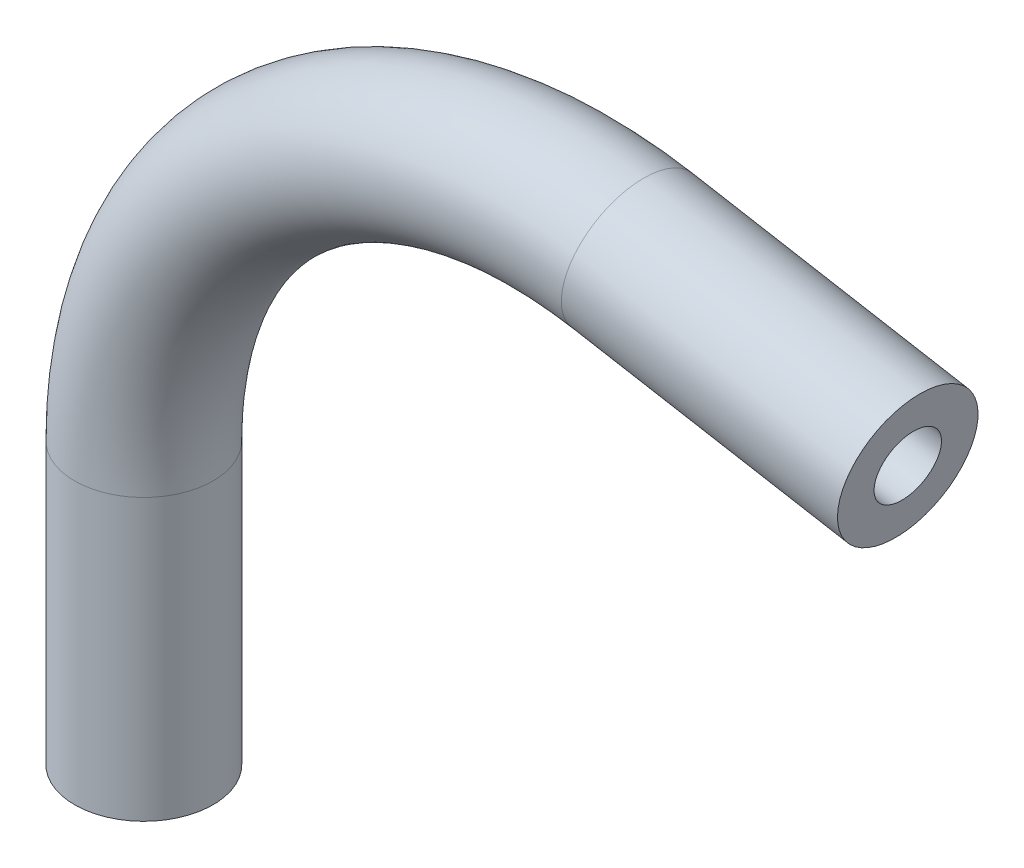
ISO-10303-21;
HEADER;
FILE_DESCRIPTION(('STEP AP214'),'2;1');
FILE_NAME('part.step','',(''),(''),'','','');
FILE_SCHEMA(('AUTOMOTIVE_DESIGN { 1 0 10303 214 1 1 1 1 }'));
ENDSEC;
DATA;
#1=APPLICATION_CONTEXT('core data for automotive mechanical design processes');
#2=APPLICATION_PROTOCOL_DEFINITION('international standard','automotive_design',2000,#1);
#3=PRODUCT_CONTEXT('',#1,'mechanical');
#4=PRODUCT('Part','Part','',(#3));
#5=PRODUCT_RELATED_PRODUCT_CATEGORY('part','',(#4));
#6=PRODUCT_DEFINITION_FORMATION('','',#4);
#7=PRODUCT_DEFINITION_CONTEXT('part definition',#1,'design');
#8=PRODUCT_DEFINITION('design','',#6,#7);
#9=PRODUCT_DEFINITION_SHAPE('','',#8);
#10=(LENGTH_UNIT() NAMED_UNIT(*) SI_UNIT(.MILLI.,.METRE.));
#11=(NAMED_UNIT(*) PLANE_ANGLE_UNIT() SI_UNIT($,.RADIAN.));
#12=(NAMED_UNIT(*) SI_UNIT($,.STERADIAN.) SOLID_ANGLE_UNIT());
#13=UNCERTAINTY_MEASURE_WITH_UNIT(LENGTH_MEASURE(1.E-05),#10,'distance_accuracy_value','');
#14=(GEOMETRIC_REPRESENTATION_CONTEXT(3) GLOBAL_UNCERTAINTY_ASSIGNED_CONTEXT((#13)) GLOBAL_UNIT_ASSIGNED_CONTEXT((#10,
#11,#12)) REPRESENTATION_CONTEXT('',''));
#15=CARTESIAN_POINT('',(0.,0.,0.));
#16=DIRECTION('',(0.,0.,1.));
#17=DIRECTION('',(1.,0.,0.));
#18=AXIS2_PLACEMENT_3D('',#15,#16,#17);
#19=CARTESIAN_POINT('',(0.,-14.3794119418749,0.));
#20=DIRECTION('',(0.,1.,0.));
#21=DIRECTION('',(-1.,0.,0.));
#22=AXIS2_PLACEMENT_3D('',#19,#20,#21);
#23=CYLINDRICAL_SURFACE('',#22,3.175);
#24=CARTESIAN_POINT('',(0.,-1.52231788079481,0.));
#25=DIRECTION('',(0.,1.,0.));
#26=DIRECTION('',(-1.,0.,0.));
#27=AXIS2_PLACEMENT_3D('',#24,#25,#26);
#28=CIRCLE('',#27,3.175);
#29=CARTESIAN_POINT('',(-3.17500000000001,-1.52231788079483,0.));
#30=VERTEX_POINT('',#29);
#31=EDGE_CURVE('E90',#30,#30,#28,.T.);
#32=ORIENTED_EDGE('',*,*,#31,.F.);
#33=EDGE_LOOP('',(#32));
#34=FACE_BOUND('',#33,.T.);
#35=CARTESIAN_POINT('',(0.,-14.3794119418749,0.));
#36=DIRECTION('',(0.,1.,0.));
#37=DIRECTION('',(-1.,0.,0.));
#38=AXIS2_PLACEMENT_3D('',#35,#36,#37);
#39=CIRCLE('',#38,3.175);
#40=CARTESIAN_POINT('',(-3.17500000000001,-14.3794119418749,0.));
#41=VERTEX_POINT('',#40);
#42=EDGE_CURVE('E55',#41,#41,#39,.T.);
#43=ORIENTED_EDGE('',*,*,#42,.T.);
#44=EDGE_LOOP('',(#43));
#45=FACE_BOUND('',#44,.T.);
#46=ADVANCED_FACE('F39',(#34,#45),#23,.T.);
#47=CARTESIAN_POINT('',(19.05,-1.52231788079469,0.));
#48=DIRECTION('',(0.,0.,-1.));
#49=DIRECTION('',(-1.,0.,0.));
#50=AXIS2_PLACEMENT_3D('',#47,#48,#49);
#51=TOROIDAL_SURFACE('',#50,19.05,3.175);
#52=CARTESIAN_POINT('',(22.3579977845551,17.2382698140878,0.));
#53=DIRECTION('',(0.984807753012207,-0.173648177666934,0.));
#54=DIRECTION('',(0.173648177666934,0.984807753012208,0.));
#55=AXIS2_PLACEMENT_3D('',#52,#53,#54);
#56=CIRCLE('',#55,3.175);
#57=CARTESIAN_POINT('',(22.9093307486476,20.3650344299016,0.));
#58=VERTEX_POINT('',#57);
#59=EDGE_CURVE('E43',#58,#58,#56,.T.);
#60=CARTESIAN_POINT('',(19.05,-1.52231788079469,0.));
#61=DIRECTION('',(0.,0.,-1.));
#62=DIRECTION('',(-1.,0.,0.));
#63=AXIS2_PLACEMENT_3D('',#60,#61,#62);
#64=CIRCLE('',#63,22.225);
#65=EDGE_CURVE('',#30,#58,#64,.T.);
#66=ORIENTED_EDGE('',*,*,#31,.T.);
#67=ORIENTED_EDGE('',*,*,#59,.F.);
#68=ORIENTED_EDGE('',*,*,#65,.T.);
#69=ORIENTED_EDGE('',*,*,#65,.F.);
#70=EDGE_LOOP('',(#66,#68,#67,#69));
#71=FACE_BOUND('',#70,.T.);
#72=ADVANCED_FACE('F100',(#71),#51,.T.);
#73=CARTESIAN_POINT('',(22.3579977845551,17.2382698140879,0.));
#74=DIRECTION('',(0.984807753012207,-0.173648177666934,0.));
#75=DIRECTION('',(0.173648177666934,0.984807753012208,0.));
#76=AXIS2_PLACEMENT_3D('',#73,#74,#75);
#77=CYLINDRICAL_SURFACE('',#76,3.175);
#78=CARTESIAN_POINT('',(35.0197636971141,15.0056588602889,0.));
#79=DIRECTION('',(0.984807753012207,-0.173648177666934,0.));
#80=DIRECTION('',(0.173648177666934,0.984807753012208,0.));
#81=AXIS2_PLACEMENT_3D('',#78,#79,#80);
#82=CIRCLE('',#81,3.175);
#83=CARTESIAN_POINT('',(35.5710966612066,18.1324234761027,0.));
#84=VERTEX_POINT('',#83);
#85=EDGE_CURVE('E60',#84,#84,#82,.T.);
#86=ORIENTED_EDGE('',*,*,#85,.F.);
#87=EDGE_LOOP('',(#86));
#88=FACE_BOUND('',#87,.T.);
#89=ORIENTED_EDGE('',*,*,#59,.T.);
#90=EDGE_LOOP('',(#89));
#91=FACE_BOUND('',#90,.T.);
#92=ADVANCED_FACE('F41',(#88,#91),#77,.T.);
#93=CARTESIAN_POINT('',(0.,-14.3794119418749,0.));
#94=DIRECTION('',(0.,1.,0.));
#95=DIRECTION('',(-1.,0.,0.));
#96=AXIS2_PLACEMENT_3D('',#93,#94,#95);
#97=PLANE('',#96);
#98=CARTESIAN_POINT('',(0.,-14.3794119418749,0.));
#99=DIRECTION('',(0.,1.,0.));
#100=DIRECTION('',(-1.,0.,0.));
#101=AXIS2_PLACEMENT_3D('',#98,#99,#100);
#102=CIRCLE('',#101,1.524);
#103=CARTESIAN_POINT('',(-1.52400000000001,-14.3794119418749,0.));
#104=VERTEX_POINT('',#103);
#105=EDGE_CURVE('E83',#104,#104,#102,.F.);
#106=ORIENTED_EDGE('',*,*,#105,.F.);
#107=EDGE_LOOP('',(#106));
#108=FACE_BOUND('',#107,.T.);
#109=ORIENTED_EDGE('',*,*,#42,.F.);
#110=EDGE_LOOP('',(#109));
#111=FACE_BOUND('',#110,.T.);
#112=ADVANCED_FACE('F106',(#108,#111),#97,.F.);
#113=CARTESIAN_POINT('',(35.0197636971141,15.0056588602889,0.));
#114=DIRECTION('',(0.984807753012207,-0.173648177666934,0.));
#115=DIRECTION('',(0.173648177666934,0.984807753012208,0.));
#116=AXIS2_PLACEMENT_3D('',#113,#114,#115);
#117=PLANE('',#116);
#118=CARTESIAN_POINT('',(35.0197636971141,15.0056588602889,0.));
#119=DIRECTION('',(0.984807753012207,-0.173648177666934,0.));
#120=DIRECTION('',(0.173648177666934,0.984807753012208,0.));
#121=AXIS2_PLACEMENT_3D('',#118,#119,#120);
#122=CIRCLE('',#121,1.524);
#123=CARTESIAN_POINT('',(35.2844035198785,16.5065058758795,0.));
#124=VERTEX_POINT('',#123);
#125=EDGE_CURVE('E11',#124,#124,#122,.F.);
#126=ORIENTED_EDGE('',*,*,#125,.T.);
#127=EDGE_LOOP('',(#126));
#128=FACE_BOUND('',#127,.T.);
#129=ORIENTED_EDGE('',*,*,#85,.T.);
#130=EDGE_LOOP('',(#129));
#131=FACE_BOUND('',#130,.T.);
#132=ADVANCED_FACE('F67',(#128,#131),#117,.T.);
#133=CARTESIAN_POINT('',(0.,-14.3794119418749,0.));
#134=DIRECTION('',(0.,1.,0.));
#135=DIRECTION('',(-1.,0.,0.));
#136=AXIS2_PLACEMENT_3D('',#133,#134,#135);
#137=CYLINDRICAL_SURFACE('',#136,1.524);
#138=CARTESIAN_POINT('',(0.,-1.52231788079481,0.));
#139=DIRECTION('',(0.,1.,0.));
#140=DIRECTION('',(-1.,0.,0.));
#141=AXIS2_PLACEMENT_3D('',#138,#139,#140);
#142=CIRCLE('',#141,1.524);
#143=CARTESIAN_POINT('',(-1.52400000000001,-1.52231788079482,0.));
#144=VERTEX_POINT('',#143);
#145=EDGE_CURVE('E79',#144,#144,#142,.F.);
#146=ORIENTED_EDGE('',*,*,#145,.F.);
#147=EDGE_LOOP('',(#146));
#148=FACE_BOUND('',#147,.T.);
#149=ORIENTED_EDGE('',*,*,#105,.T.);
#150=EDGE_LOOP('',(#149));
#151=FACE_BOUND('',#150,.T.);
#152=ADVANCED_FACE('F114',(#148,#151),#137,.F.);
#153=CARTESIAN_POINT('',(19.05,-1.52231788079469,0.));
#154=DIRECTION('',(0.,0.,-1.));
#155=DIRECTION('',(-1.,0.,0.));
#156=AXIS2_PLACEMENT_3D('',#153,#154,#155);
#157=TOROIDAL_SURFACE('',#156,19.05,1.524);
#158=CARTESIAN_POINT('',(22.3579977845551,17.2382698140878,0.));
#159=DIRECTION('',(0.984807753012207,-0.173648177666934,0.));
#160=DIRECTION('',(0.173648177666934,0.984807753012208,0.));
#161=AXIS2_PLACEMENT_3D('',#158,#159,#160);
#162=CIRCLE('',#161,1.524);
#163=CARTESIAN_POINT('',(22.6226376073195,18.7391168296785,0.));
#164=VERTEX_POINT('',#163);
#165=EDGE_CURVE('E49',#164,#164,#162,.F.);
#166=CARTESIAN_POINT('',(19.05,-1.52231788079469,0.));
#167=DIRECTION('',(0.,0.,-1.));
#168=DIRECTION('',(-1.,0.,0.));
#169=AXIS2_PLACEMENT_3D('',#166,#167,#168);
#170=CIRCLE('',#169,20.574);
#171=EDGE_CURVE('',#144,#164,#170,.T.);
#172=ORIENTED_EDGE('',*,*,#145,.T.);
#173=ORIENTED_EDGE('',*,*,#165,.F.);
#174=ORIENTED_EDGE('',*,*,#171,.T.);
#175=ORIENTED_EDGE('',*,*,#171,.F.);
#176=EDGE_LOOP('',(#172,#174,#173,#175));
#177=FACE_BOUND('',#176,.T.);
#178=ADVANCED_FACE('F73',(#177),#157,.F.);
#179=CARTESIAN_POINT('',(22.3579977845551,17.2382698140879,0.));
#180=DIRECTION('',(0.984807753012207,-0.173648177666934,0.));
#181=DIRECTION('',(0.173648177666934,0.984807753012208,0.));
#182=AXIS2_PLACEMENT_3D('',#179,#180,#181);
#183=CYLINDRICAL_SURFACE('',#182,1.524);
#184=ORIENTED_EDGE('',*,*,#125,.F.);
#185=EDGE_LOOP('',(#184));
#186=FACE_BOUND('',#185,.T.);
#187=ORIENTED_EDGE('',*,*,#165,.T.);
#188=EDGE_LOOP('',(#187));
#189=FACE_BOUND('',#188,.T.);
#190=ADVANCED_FACE('F70',(#186,#189),#183,.F.);
#191=CLOSED_SHELL('',(#46,#72,#92,#112,#132,#152,#178,#190));
#192=MANIFOLD_SOLID_BREP('B2',#191);
#193=ADVANCED_BREP_SHAPE_REPRESENTATION('',(#18,#192),#14);
#194=SHAPE_DEFINITION_REPRESENTATION(#9,#193);
ENDSEC;
END-ISO-10303-21;
